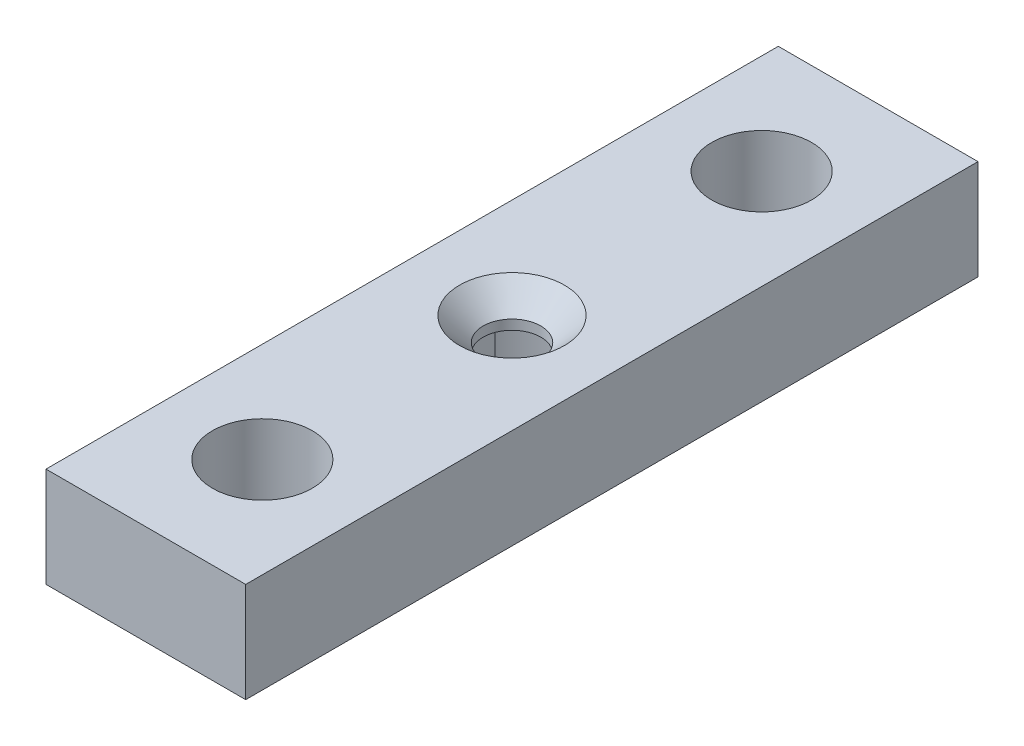
ISO-10303-21;
HEADER;
FILE_DESCRIPTION(('STEP AP214'),'2;1');
FILE_NAME('part.step','',(''),(''),'','','');
FILE_SCHEMA(('AUTOMOTIVE_DESIGN { 1 0 10303 214 1 1 1 1 }'));
ENDSEC;
DATA;
#1=APPLICATION_CONTEXT('core data for automotive mechanical design processes');
#2=APPLICATION_PROTOCOL_DEFINITION('international standard','automotive_design',2000,#1);
#3=PRODUCT_CONTEXT('',#1,'mechanical');
#4=PRODUCT('Part','Part','',(#3));
#5=PRODUCT_RELATED_PRODUCT_CATEGORY('part','',(#4));
#6=PRODUCT_DEFINITION_FORMATION('','',#4);
#7=PRODUCT_DEFINITION_CONTEXT('part definition',#1,'design');
#8=PRODUCT_DEFINITION('design','',#6,#7);
#9=PRODUCT_DEFINITION_SHAPE('','',#8);
#10=(LENGTH_UNIT() NAMED_UNIT(*) SI_UNIT(.MILLI.,.METRE.));
#11=(NAMED_UNIT(*) PLANE_ANGLE_UNIT() SI_UNIT($,.RADIAN.));
#12=(NAMED_UNIT(*) SI_UNIT($,.STERADIAN.) SOLID_ANGLE_UNIT());
#13=UNCERTAINTY_MEASURE_WITH_UNIT(LENGTH_MEASURE(1.E-05),#10,'distance_accuracy_value','');
#14=(GEOMETRIC_REPRESENTATION_CONTEXT(3) GLOBAL_UNCERTAINTY_ASSIGNED_CONTEXT((#13)) GLOBAL_UNIT_ASSIGNED_CONTEXT((#10,
#11,#12)) REPRESENTATION_CONTEXT('',''));
#15=CARTESIAN_POINT('',(0.,0.,0.));
#16=DIRECTION('',(0.,0.,1.));
#17=DIRECTION('',(1.,0.,0.));
#18=AXIS2_PLACEMENT_3D('',#15,#16,#17);
#19=CARTESIAN_POINT('',(0.,3.175,0.));
#20=DIRECTION('',(0.,-1.,0.));
#21=DIRECTION('',(0.,0.,-1.));
#22=AXIS2_PLACEMENT_3D('',#19,#20,#21);
#23=CYLINDRICAL_SURFACE('',#22,15.9385);
#24=CARTESIAN_POINT('',(0.,-9.525,0.));
#25=DIRECTION('',(0.,-1.,0.));
#26=DIRECTION('',(0.,0.,-1.));
#27=AXIS2_PLACEMENT_3D('',#24,#25,#26);
#28=CIRCLE('',#27,15.9385);
#29=CARTESIAN_POINT('',(-12.7635,-9.525,-9.54614320026679));
#30=VERTEX_POINT('',#29);
#31=CARTESIAN_POINT('',(12.7635,-9.525,-9.54614320026679));
#32=VERTEX_POINT('',#31);
#33=EDGE_CURVE('E110',#30,#32,#28,.T.);
#34=ORIENTED_EDGE('',*,*,#33,.T.);
#35=DIRECTION('',(0.,-1.,0.));
#36=VECTOR('',#35,1.);
#37=CARTESIAN_POINT('',(12.7635,22.5294833307428,-9.54614320026679));
#38=LINE('',#37,#36);
#39=CARTESIAN_POINT('',(12.7635,3.175,-9.54614320026679));
#40=VERTEX_POINT('',#39);
#41=EDGE_CURVE('E56',#40,#32,#38,.T.);
#42=ORIENTED_EDGE('',*,*,#41,.F.);
#43=CARTESIAN_POINT('',(0.,3.175,0.));
#44=DIRECTION('',(0.,-1.,0.));
#45=DIRECTION('',(0.,0.,-1.));
#46=AXIS2_PLACEMENT_3D('',#43,#44,#45);
#47=CIRCLE('',#46,15.9385);
#48=CARTESIAN_POINT('',(-12.7635,3.175,-9.54614320026679));
#49=VERTEX_POINT('',#48);
#50=EDGE_CURVE('E131',#49,#40,#47,.T.);
#51=ORIENTED_EDGE('',*,*,#50,.F.);
#52=DIRECTION('',(0.,-1.,0.));
#53=VECTOR('',#52,1.);
#54=CARTESIAN_POINT('',(-12.7635,22.5294833307428,-9.54614320026679));
#55=LINE('',#54,#53);
#56=EDGE_CURVE('E125',#49,#30,#55,.T.);
#57=ORIENTED_EDGE('',*,*,#56,.T.);
#58=EDGE_LOOP('',(#34,#42,#51,#57));
#59=FACE_BOUND('',#58,.T.);
#60=ADVANCED_FACE('F32',(#59),#23,.F.);
#61=CARTESIAN_POINT('',(0.,9.525,0.));
#62=DIRECTION('',(0.,1.,0.));
#63=DIRECTION('',(0.,0.,1.));
#64=AXIS2_PLACEMENT_3D('',#61,#62,#63);
#65=CYLINDRICAL_SURFACE('',#64,5.49999999999999);
#66=CARTESIAN_POINT('',(0.,5.025,0.));
#67=DIRECTION('',(0.,1.,0.));
#68=DIRECTION('',(0.,0.,1.));
#69=AXIS2_PLACEMENT_3D('',#66,#67,#68);
#70=CIRCLE('',#69,5.5);
#71=CARTESIAN_POINT('',(0.,5.025,5.5));
#72=VERTEX_POINT('',#71);
#73=EDGE_CURVE('E136',#72,#72,#70,.T.);
#74=ORIENTED_EDGE('',*,*,#73,.T.);
#75=EDGE_LOOP('',(#74));
#76=FACE_BOUND('',#75,.T.);
#77=CARTESIAN_POINT('',(0.,3.175,0.));
#78=DIRECTION('',(0.,-1.,0.));
#79=DIRECTION('',(0.,0.,-1.));
#80=AXIS2_PLACEMENT_3D('',#77,#78,#79);
#81=CIRCLE('',#80,5.49999999999999);
#82=CARTESIAN_POINT('',(0.,3.175,-5.49999999999999));
#83=VERTEX_POINT('',#82);
#84=EDGE_CURVE('E36',#83,#83,#81,.F.);
#85=ORIENTED_EDGE('',*,*,#84,.F.);
#86=EDGE_LOOP('',(#85));
#87=FACE_BOUND('',#86,.T.);
#88=ADVANCED_FACE('F203',(#76,#87),#65,.F.);
#89=CARTESIAN_POINT('',(19.05,9.525,69.85));
#90=DIRECTION('',(-1.,0.,0.));
#91=DIRECTION('',(0.,-1.,0.));
#92=AXIS2_PLACEMENT_3D('',#89,#90,#91);
#93=PLANE('',#92);
#94=DIRECTION('',(0.,1.,0.));
#95=VECTOR('',#94,1.);
#96=CARTESIAN_POINT('',(19.05,9.525,-69.85));
#97=LINE('',#96,#95);
#98=CARTESIAN_POINT('',(19.05,-9.525,-69.85));
#99=VERTEX_POINT('',#98);
#100=CARTESIAN_POINT('',(19.05,9.525,-69.85));
#101=VERTEX_POINT('',#100);
#102=EDGE_CURVE('E147',#99,#101,#97,.T.);
#103=ORIENTED_EDGE('',*,*,#102,.T.);
#104=DIRECTION('',(0.,0.,-1.));
#105=VECTOR('',#104,1.);
#106=CARTESIAN_POINT('',(19.05,9.525,69.85));
#107=LINE('',#106,#105);
#108=CARTESIAN_POINT('',(19.05,9.525,69.85));
#109=VERTEX_POINT('',#108);
#110=EDGE_CURVE('E11',#109,#101,#107,.T.);
#111=ORIENTED_EDGE('',*,*,#110,.F.);
#112=DIRECTION('',(0.,1.,0.));
#113=VECTOR('',#112,1.);
#114=CARTESIAN_POINT('',(19.05,9.525,69.85));
#115=LINE('',#114,#113);
#116=CARTESIAN_POINT('',(19.05,-9.525,69.85));
#117=VERTEX_POINT('',#116);
#118=EDGE_CURVE('E152',#117,#109,#115,.T.);
#119=ORIENTED_EDGE('',*,*,#118,.F.);
#120=DIRECTION('',(0.,0.,-1.));
#121=VECTOR('',#120,1.);
#122=CARTESIAN_POINT('',(19.05,-9.525,69.85));
#123=LINE('',#122,#121);
#124=EDGE_CURVE('E162',#117,#99,#123,.T.);
#125=ORIENTED_EDGE('',*,*,#124,.T.);
#126=EDGE_LOOP('',(#103,#111,#119,#125));
#127=FACE_BOUND('',#126,.T.);
#128=ADVANCED_FACE('F34',(#127),#93,.F.);
#129=CARTESIAN_POINT('',(-19.05,9.525,69.85));
#130=DIRECTION('',(0.,-1.,0.));
#131=DIRECTION('',(0.,0.,-1.));
#132=AXIS2_PLACEMENT_3D('',#129,#130,#131);
#133=PLANE('',#132);
#134=CARTESIAN_POINT('',(0.,9.525,0.));
#135=DIRECTION('',(0.,1.,0.));
#136=DIRECTION('',(0.,0.,1.));
#137=AXIS2_PLACEMENT_3D('',#134,#135,#136);
#138=CIRCLE('',#137,10.);
#139=CARTESIAN_POINT('',(0.,9.525,10.));
#140=VERTEX_POINT('',#139);
#141=EDGE_CURVE('E133',#140,#140,#138,.T.);
#142=ORIENTED_EDGE('',*,*,#141,.F.);
#143=EDGE_LOOP('',(#142));
#144=FACE_BOUND('',#143,.T.);
#145=CARTESIAN_POINT('',(0.,9.525,-47.625));
#146=DIRECTION('',(0.,1.,0.));
#147=DIRECTION('',(0.,0.,1.));
#148=AXIS2_PLACEMENT_3D('',#145,#146,#147);
#149=CIRCLE('',#148,9.525);
#150=CARTESIAN_POINT('',(0.,9.525,-38.1));
#151=VERTEX_POINT('',#150);
#152=EDGE_CURVE('E140',#151,#151,#149,.T.);
#153=ORIENTED_EDGE('',*,*,#152,.F.);
#154=EDGE_LOOP('',(#153));
#155=FACE_BOUND('',#154,.T.);
#156=CARTESIAN_POINT('',(0.,9.525,47.625));
#157=DIRECTION('',(0.,1.,0.));
#158=DIRECTION('',(0.,0.,1.));
#159=AXIS2_PLACEMENT_3D('',#156,#157,#158);
#160=CIRCLE('',#159,9.525);
#161=CARTESIAN_POINT('',(0.,9.525,57.15));
#162=VERTEX_POINT('',#161);
#163=EDGE_CURVE('E139',#162,#162,#160,.T.);
#164=ORIENTED_EDGE('',*,*,#163,.F.);
#165=EDGE_LOOP('',(#164));
#166=FACE_BOUND('',#165,.T.);
#167=DIRECTION('',(-1.,0.,0.));
#168=VECTOR('',#167,1.);
#169=CARTESIAN_POINT('',(-19.05,9.525,-69.85));
#170=LINE('',#169,#168);
#171=CARTESIAN_POINT('',(-19.05,9.525,-69.85));
#172=VERTEX_POINT('',#171);
#173=EDGE_CURVE('E165',#101,#172,#170,.T.);
#174=ORIENTED_EDGE('',*,*,#173,.T.);
#175=DIRECTION('',(0.,0.,-1.));
#176=VECTOR('',#175,1.);
#177=CARTESIAN_POINT('',(-19.05,9.525,69.85));
#178=LINE('',#177,#176);
#179=CARTESIAN_POINT('',(-19.05,9.525,69.85));
#180=VERTEX_POINT('',#179);
#181=EDGE_CURVE('E41',#180,#172,#178,.T.);
#182=ORIENTED_EDGE('',*,*,#181,.F.);
#183=DIRECTION('',(-1.,0.,0.));
#184=VECTOR('',#183,1.);
#185=CARTESIAN_POINT('',(-19.05,9.525,69.85));
#186=LINE('',#185,#184);
#187=EDGE_CURVE('E155',#109,#180,#186,.T.);
#188=ORIENTED_EDGE('',*,*,#187,.F.);
#189=ORIENTED_EDGE('',*,*,#110,.T.);
#190=EDGE_LOOP('',(#174,#182,#188,#189));
#191=FACE_BOUND('',#190,.T.);
#192=ADVANCED_FACE('F195',(#144,#155,#166,#191),#133,.F.);
#193=CARTESIAN_POINT('',(-19.05,9.525,69.85));
#194=DIRECTION('',(1.,0.,0.));
#195=DIRECTION('',(0.,1.,0.));
#196=AXIS2_PLACEMENT_3D('',#193,#194,#195);
#197=PLANE('',#196);
#198=DIRECTION('',(0.,-1.,0.));
#199=VECTOR('',#198,1.);
#200=CARTESIAN_POINT('',(-19.05,9.525,-69.85));
#201=LINE('',#200,#199);
#202=CARTESIAN_POINT('',(-19.05,-9.525,-69.85));
#203=VERTEX_POINT('',#202);
#204=EDGE_CURVE('E167',#172,#203,#201,.T.);
#205=ORIENTED_EDGE('',*,*,#204,.T.);
#206=DIRECTION('',(0.,0.,-1.));
#207=VECTOR('',#206,1.);
#208=CARTESIAN_POINT('',(-19.05,-9.525,69.85));
#209=LINE('',#208,#207);
#210=CARTESIAN_POINT('',(-19.05,-9.525,69.85));
#211=VERTEX_POINT('',#210);
#212=EDGE_CURVE('E172',#211,#203,#209,.T.);
#213=ORIENTED_EDGE('',*,*,#212,.F.);
#214=DIRECTION('',(0.,-1.,0.));
#215=VECTOR('',#214,1.);
#216=CARTESIAN_POINT('',(-19.05,9.525,69.85));
#217=LINE('',#216,#215);
#218=EDGE_CURVE('E158',#180,#211,#217,.T.);
#219=ORIENTED_EDGE('',*,*,#218,.F.);
#220=ORIENTED_EDGE('',*,*,#181,.T.);
#221=EDGE_LOOP('',(#205,#213,#219,#220));
#222=FACE_BOUND('',#221,.T.);
#223=ADVANCED_FACE('F180',(#222),#197,.F.);
#224=CARTESIAN_POINT('',(-19.05,-9.525,69.85));
#225=DIRECTION('',(0.,1.,0.));
#226=DIRECTION('',(0.,0.,1.));
#227=AXIS2_PLACEMENT_3D('',#224,#225,#226);
#228=PLANE('',#227);
#229=ORIENTED_EDGE('',*,*,#33,.F.);
#230=DIRECTION('',(0.,0.,1.));
#231=VECTOR('',#230,1.);
#232=CARTESIAN_POINT('',(-12.7635,-9.525,9.54614320026679));
#233=LINE('',#232,#231);
#234=CARTESIAN_POINT('',(-12.7635,-9.525,9.54614320026679));
#235=VERTEX_POINT('',#234);
#236=EDGE_CURVE('E106',#30,#235,#233,.T.);
#237=ORIENTED_EDGE('',*,*,#236,.T.);
#238=CARTESIAN_POINT('',(12.7635,-9.525,9.54614320026679));
#239=VERTEX_POINT('',#238);
#240=EDGE_CURVE('E99',#239,#235,#28,.T.);
#241=ORIENTED_EDGE('',*,*,#240,.F.);
#242=DIRECTION('',(0.,0.,-1.));
#243=VECTOR('',#242,1.);
#244=CARTESIAN_POINT('',(12.7635,-9.525,9.54614320026679));
#245=LINE('',#244,#243);
#246=EDGE_CURVE('E104',#239,#32,#245,.T.);
#247=ORIENTED_EDGE('',*,*,#246,.T.);
#248=EDGE_LOOP('',(#229,#237,#241,#247));
#249=FACE_BOUND('',#248,.T.);
#250=CARTESIAN_POINT('',(0.,-9.525,-47.625));
#251=DIRECTION('',(0.,1.,0.));
#252=DIRECTION('',(0.,0.,1.));
#253=AXIS2_PLACEMENT_3D('',#250,#251,#252);
#254=CIRCLE('',#253,9.525);
#255=CARTESIAN_POINT('',(0.,-9.525,-38.1));
#256=VERTEX_POINT('',#255);
#257=EDGE_CURVE('E143',#256,#256,#254,.F.);
#258=ORIENTED_EDGE('',*,*,#257,.F.);
#259=EDGE_LOOP('',(#258));
#260=FACE_BOUND('',#259,.T.);
#261=CARTESIAN_POINT('',(0.,-9.525,47.625));
#262=DIRECTION('',(0.,1.,0.));
#263=DIRECTION('',(0.,0.,1.));
#264=AXIS2_PLACEMENT_3D('',#261,#262,#263);
#265=CIRCLE('',#264,9.525);
#266=CARTESIAN_POINT('',(0.,-9.525,57.15));
#267=VERTEX_POINT('',#266);
#268=EDGE_CURVE('E144',#267,#267,#265,.F.);
#269=ORIENTED_EDGE('',*,*,#268,.F.);
#270=EDGE_LOOP('',(#269));
#271=FACE_BOUND('',#270,.T.);
#272=DIRECTION('',(1.,0.,0.));
#273=VECTOR('',#272,1.);
#274=CARTESIAN_POINT('',(-19.05,-9.525,-69.85));
#275=LINE('',#274,#273);
#276=EDGE_CURVE('E156',#203,#99,#275,.T.);
#277=ORIENTED_EDGE('',*,*,#276,.T.);
#278=ORIENTED_EDGE('',*,*,#124,.F.);
#279=DIRECTION('',(1.,0.,0.));
#280=VECTOR('',#279,1.);
#281=CARTESIAN_POINT('',(-19.05,-9.525,69.85));
#282=LINE('',#281,#280);
#283=EDGE_CURVE('E160',#211,#117,#282,.T.);
#284=ORIENTED_EDGE('',*,*,#283,.F.);
#285=ORIENTED_EDGE('',*,*,#212,.T.);
#286=EDGE_LOOP('',(#277,#278,#284,#285));
#287=FACE_BOUND('',#286,.T.);
#288=ADVANCED_FACE('F101',(#249,#260,#271,#287),#228,.F.);
#289=CARTESIAN_POINT('',(19.05,-9.525,69.85));
#290=DIRECTION('',(0.,0.,1.));
#291=DIRECTION('',(1.,0.,0.));
#292=AXIS2_PLACEMENT_3D('',#289,#290,#291);
#293=PLANE('',#292);
#294=ORIENTED_EDGE('',*,*,#118,.T.);
#295=ORIENTED_EDGE('',*,*,#187,.T.);
#296=ORIENTED_EDGE('',*,*,#218,.T.);
#297=ORIENTED_EDGE('',*,*,#283,.T.);
#298=EDGE_LOOP('',(#294,#295,#296,#297));
#299=FACE_BOUND('',#298,.T.);
#300=ADVANCED_FACE('F194',(#299),#293,.T.);
#301=CARTESIAN_POINT('',(19.05,-9.525,-69.85));
#302=DIRECTION('',(0.,0.,1.));
#303=DIRECTION('',(1.,0.,0.));
#304=AXIS2_PLACEMENT_3D('',#301,#302,#303);
#305=PLANE('',#304);
#306=ORIENTED_EDGE('',*,*,#102,.F.);
#307=ORIENTED_EDGE('',*,*,#276,.F.);
#308=ORIENTED_EDGE('',*,*,#204,.F.);
#309=ORIENTED_EDGE('',*,*,#173,.F.);
#310=EDGE_LOOP('',(#306,#307,#308,#309));
#311=FACE_BOUND('',#310,.T.);
#312=ADVANCED_FACE('F186',(#311),#305,.F.);
#313=CARTESIAN_POINT('',(0.,-9.526,47.625));
#314=DIRECTION('',(0.,1.,0.));
#315=DIRECTION('',(0.,0.,1.));
#316=AXIS2_PLACEMENT_3D('',#313,#314,#315);
#317=CYLINDRICAL_SURFACE('',#316,9.525);
#318=ORIENTED_EDGE('',*,*,#163,.T.);
#319=EDGE_LOOP('',(#318));
#320=FACE_BOUND('',#319,.T.);
#321=ORIENTED_EDGE('',*,*,#268,.T.);
#322=EDGE_LOOP('',(#321));
#323=FACE_BOUND('',#322,.T.);
#324=ADVANCED_FACE('F288',(#320,#323),#317,.F.);
#325=CARTESIAN_POINT('',(0.,-9.526,-47.625));
#326=DIRECTION('',(0.,1.,0.));
#327=DIRECTION('',(0.,0.,1.));
#328=AXIS2_PLACEMENT_3D('',#325,#326,#327);
#329=CYLINDRICAL_SURFACE('',#328,9.525);
#330=ORIENTED_EDGE('',*,*,#152,.T.);
#331=EDGE_LOOP('',(#330));
#332=FACE_BOUND('',#331,.T.);
#333=ORIENTED_EDGE('',*,*,#257,.T.);
#334=EDGE_LOOP('',(#333));
#335=FACE_BOUND('',#334,.T.);
#336=ADVANCED_FACE('F228',(#332,#335),#329,.F.);
#337=CARTESIAN_POINT('',(0.,9.525,0.));
#338=DIRECTION('',(0.,1.,0.));
#339=DIRECTION('',(0.,0.,1.));
#340=AXIS2_PLACEMENT_3D('',#337,#338,#339);
#341=CONICAL_SURFACE('',#340,10.,0.785398163397449);
#342=ORIENTED_EDGE('',*,*,#73,.F.);
#343=EDGE_LOOP('',(#342));
#344=FACE_BOUND('',#343,.T.);
#345=ORIENTED_EDGE('',*,*,#141,.T.);
#346=EDGE_LOOP('',(#345));
#347=FACE_BOUND('',#346,.T.);
#348=ADVANCED_FACE('F224',(#344,#347),#341,.F.);
#349=CARTESIAN_POINT('',(0.,3.175,0.));
#350=DIRECTION('',(0.,-1.,0.));
#351=DIRECTION('',(0.,0.,-1.));
#352=AXIS2_PLACEMENT_3D('',#349,#350,#351);
#353=PLANE('',#352);
#354=DIRECTION('',(0.,0.,1.));
#355=VECTOR('',#354,1.);
#356=CARTESIAN_POINT('',(12.7635,3.175,9.54614320026679));
#357=LINE('',#356,#355);
#358=CARTESIAN_POINT('',(12.7635,3.175,9.54614320026679));
#359=VERTEX_POINT('',#358);
#360=EDGE_CURVE('E48',#40,#359,#357,.T.);
#361=ORIENTED_EDGE('',*,*,#360,.T.);
#362=CARTESIAN_POINT('',(-12.7635,3.175,9.54614320026679));
#363=VERTEX_POINT('',#362);
#364=EDGE_CURVE('E116',#359,#363,#47,.T.);
#365=ORIENTED_EDGE('',*,*,#364,.T.);
#366=DIRECTION('',(0.,0.,-1.));
#367=VECTOR('',#366,1.);
#368=CARTESIAN_POINT('',(-12.7635,3.175,9.54614320026679));
#369=LINE('',#368,#367);
#370=EDGE_CURVE('E111',#363,#49,#369,.T.);
#371=ORIENTED_EDGE('',*,*,#370,.T.);
#372=ORIENTED_EDGE('',*,*,#50,.T.);
#373=EDGE_LOOP('',(#361,#365,#371,#372));
#374=FACE_BOUND('',#373,.T.);
#375=ORIENTED_EDGE('',*,*,#84,.T.);
#376=EDGE_LOOP('',(#375));
#377=FACE_BOUND('',#376,.T.);
#378=ADVANCED_FACE('F217',(#374,#377),#353,.T.);
#379=ORIENTED_EDGE('',*,*,#364,.F.);
#380=DIRECTION('',(0.,-1.,0.));
#381=VECTOR('',#380,1.);
#382=CARTESIAN_POINT('',(12.7635,22.5294833307428,9.54614320026679));
#383=LINE('',#382,#381);
#384=EDGE_CURVE('E114',#359,#239,#383,.T.);
#385=ORIENTED_EDGE('',*,*,#384,.T.);
#386=ORIENTED_EDGE('',*,*,#240,.T.);
#387=DIRECTION('',(0.,-1.,0.));
#388=VECTOR('',#387,1.);
#389=CARTESIAN_POINT('',(-12.7635,22.5294833307428,9.54614320026679));
#390=LINE('',#389,#388);
#391=EDGE_CURVE('E126',#363,#235,#390,.T.);
#392=ORIENTED_EDGE('',*,*,#391,.F.);
#393=EDGE_LOOP('',(#379,#385,#386,#392));
#394=FACE_BOUND('',#393,.T.);
#395=ADVANCED_FACE('F115',(#394),#23,.F.);
#396=CARTESIAN_POINT('',(-12.7635,22.5294833307428,9.54614320026679));
#397=DIRECTION('',(1.,0.,0.));
#398=DIRECTION('',(0.,0.,-1.));
#399=AXIS2_PLACEMENT_3D('',#396,#397,#398);
#400=PLANE('',#399);
#401=ORIENTED_EDGE('',*,*,#370,.F.);
#402=ORIENTED_EDGE('',*,*,#391,.T.);
#403=ORIENTED_EDGE('',*,*,#236,.F.);
#404=ORIENTED_EDGE('',*,*,#56,.F.);
#405=EDGE_LOOP('',(#401,#402,#403,#404));
#406=FACE_BOUND('',#405,.T.);
#407=ADVANCED_FACE('F216',(#406),#400,.T.);
#408=CARTESIAN_POINT('',(12.7635,22.5294833307428,9.54614320026679));
#409=DIRECTION('',(-1.,0.,0.));
#410=DIRECTION('',(0.,0.,1.));
#411=AXIS2_PLACEMENT_3D('',#408,#409,#410);
#412=PLANE('',#411);
#413=ORIENTED_EDGE('',*,*,#360,.F.);
#414=ORIENTED_EDGE('',*,*,#41,.T.);
#415=ORIENTED_EDGE('',*,*,#246,.F.);
#416=ORIENTED_EDGE('',*,*,#384,.F.);
#417=EDGE_LOOP('',(#413,#414,#415,#416));
#418=FACE_BOUND('',#417,.T.);
#419=ADVANCED_FACE('F119',(#418),#412,.T.);
#420=CLOSED_SHELL('',(#60,#88,#128,#192,#223,#288,#300,#312,#324,#336,#348,#378,#395,#407,#419));
#421=MANIFOLD_SOLID_BREP('B2',#420);
#422=ADVANCED_BREP_SHAPE_REPRESENTATION('',(#18,#421),#14);
#423=SHAPE_DEFINITION_REPRESENTATION(#9,#422);
ENDSEC;
END-ISO-10303-21;
